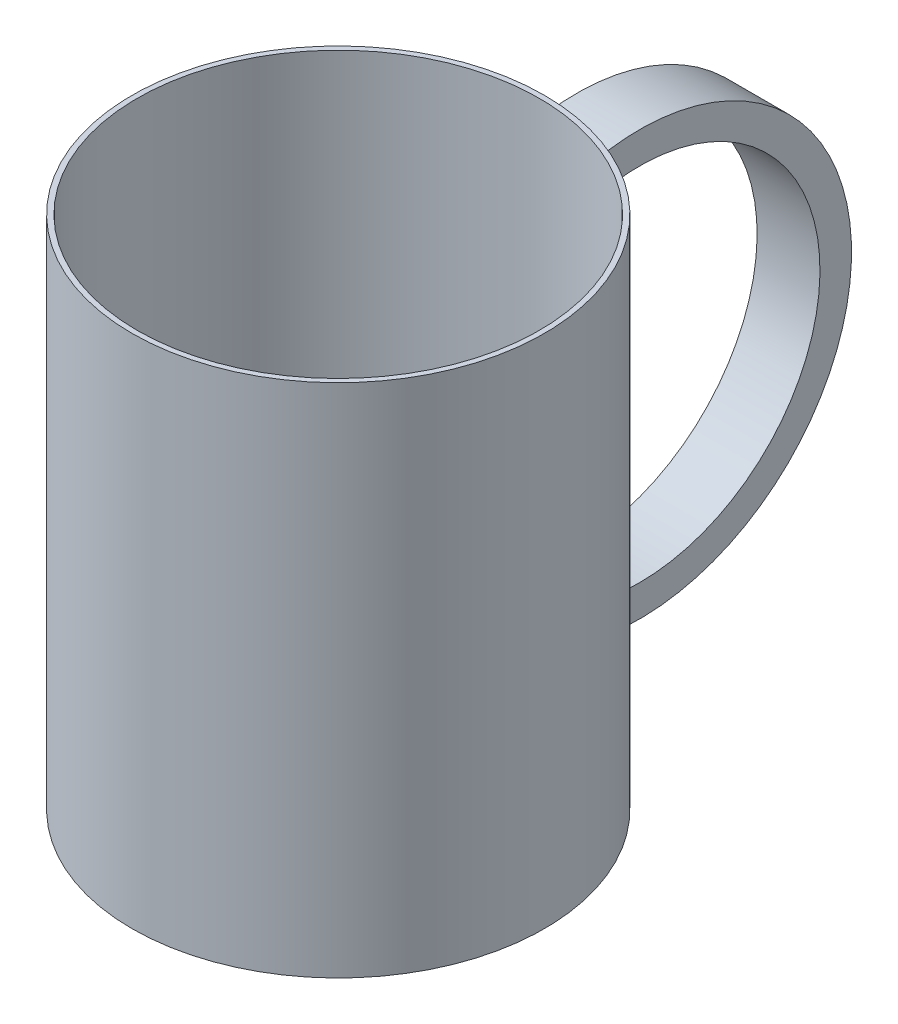
ISO-10303-21;
HEADER;
FILE_DESCRIPTION(('STEP AP214'),'2;1');
FILE_NAME('part.step','',(''),(''),'','','');
FILE_SCHEMA(('AUTOMOTIVE_DESIGN { 1 0 10303 214 1 1 1 1 }'));
ENDSEC;
DATA;
#1=APPLICATION_CONTEXT('core data for automotive mechanical design processes');
#2=APPLICATION_PROTOCOL_DEFINITION('international standard','automotive_design',2000,#1);
#3=PRODUCT_CONTEXT('',#1,'mechanical');
#4=PRODUCT('Part','Part','',(#3));
#5=PRODUCT_RELATED_PRODUCT_CATEGORY('part','',(#4));
#6=PRODUCT_DEFINITION_FORMATION('','',#4);
#7=PRODUCT_DEFINITION_CONTEXT('part definition',#1,'design');
#8=PRODUCT_DEFINITION('design','',#6,#7);
#9=PRODUCT_DEFINITION_SHAPE('','',#8);
#10=(LENGTH_UNIT() NAMED_UNIT(*) SI_UNIT(.MILLI.,.METRE.));
#11=(NAMED_UNIT(*) PLANE_ANGLE_UNIT() SI_UNIT($,.RADIAN.));
#12=(NAMED_UNIT(*) SI_UNIT($,.STERADIAN.) SOLID_ANGLE_UNIT());
#13=UNCERTAINTY_MEASURE_WITH_UNIT(LENGTH_MEASURE(1.E-05),#10,'distance_accuracy_value','');
#14=(GEOMETRIC_REPRESENTATION_CONTEXT(3) GLOBAL_UNCERTAINTY_ASSIGNED_CONTEXT((#13)) GLOBAL_UNIT_ASSIGNED_CONTEXT((#10,
#11,#12)) REPRESENTATION_CONTEXT('',''));
#15=CARTESIAN_POINT('',(0.,0.,0.));
#16=DIRECTION('',(0.,0.,1.));
#17=DIRECTION('',(1.,0.,0.));
#18=AXIS2_PLACEMENT_3D('',#15,#16,#17);
#19=CARTESIAN_POINT('',(0.,-50.,0.));
#20=DIRECTION('',(0.,-1.,0.));
#21=DIRECTION('',(0.,0.,-1.));
#22=AXIS2_PLACEMENT_3D('',#19,#20,#21);
#23=CYLINDRICAL_SURFACE('',#22,40.);
#24=CARTESIAN_POINT('',(0.,50.,0.));
#25=DIRECTION('',(0.,-1.,0.));
#26=DIRECTION('',(0.,0.,-1.));
#27=AXIS2_PLACEMENT_3D('',#24,#25,#26);
#28=CIRCLE('',#27,40.);
#29=CARTESIAN_POINT('',(0.,50.,-40.));
#30=VERTEX_POINT('',#29);
#31=EDGE_CURVE('E133',#30,#30,#28,.T.);
#32=ORIENTED_EDGE('',*,*,#31,.T.);
#33=EDGE_LOOP('',(#32));
#34=FACE_BOUND('',#33,.T.);
#35=CARTESIAN_POINT('',(0.,-50.,0.));
#36=DIRECTION('',(0.,-1.,0.));
#37=DIRECTION('',(0.,0.,-1.));
#38=AXIS2_PLACEMENT_3D('',#35,#36,#37);
#39=CIRCLE('',#38,40.);
#40=CARTESIAN_POINT('',(0.,-50.,-40.));
#41=VERTEX_POINT('',#40);
#42=EDGE_CURVE('E130',#41,#41,#39,.T.);
#43=ORIENTED_EDGE('',*,*,#42,.F.);
#44=EDGE_LOOP('',(#43));
#45=FACE_BOUND('',#44,.T.);
#46=DIRECTION('',(0.,-1.,0.));
#47=VECTOR('',#46,1.);
#48=CARTESIAN_POINT('',(-6.09820692471885,-50.,-39.5324154625456));
#49=LINE('',#48,#47);
#50=CARTESIAN_POINT('',(-6.09820692471885,37.3635523032861,-39.5324154625455));
#51=VERTEX_POINT('',#50);
#52=CARTESIAN_POINT('',(-6.09820692471885,32.5695877140828,-39.5324154625455));
#53=VERTEX_POINT('',#52);
#54=EDGE_CURVE('E166',#51,#53,#49,.T.);
#55=ORIENTED_EDGE('',*,*,#54,.T.);
#56=CARTESIAN_POINT('',(-6.09820692471885,32.5695877140828,-39.5324154625455));
#57=CARTESIAN_POINT('',(-5.59291528432792,32.6002324592508,-39.6103698923773));
#58=CARTESIAN_POINT('',(-5.08588862471012,32.6267935183053,-39.6786560820998));
#59=CARTESIAN_POINT('',(-4.06925047948424,32.6720271218711,-39.7957638779706));
#60=CARTESIAN_POINT('',(-3.55963903892991,32.6906998034049,-39.8445858222154));
#61=CARTESIAN_POINT('',(-2.54210427331402,32.720337367958,-39.9223793921129));
#62=CARTESIAN_POINT('',(-2.03419236567426,32.7313528387092,-39.951481266514));
#63=CARTESIAN_POINT('',(-1.01752030733764,32.7460225992917,-39.9902916045031));
#64=CARTESIAN_POINT('',(-0.508760153668818,32.7496768632776,-40.));
#65=CARTESIAN_POINT('',(0.508760153668819,32.7496768632776,-40.));
#66=CARTESIAN_POINT('',(1.01752030733764,32.7460225992917,-39.9902916045031));
#67=CARTESIAN_POINT('',(2.03419236567427,32.7313528387092,-39.951481266514));
#68=CARTESIAN_POINT('',(2.54210427331402,32.720337367958,-39.9223793921129));
#69=CARTESIAN_POINT('',(3.55963903892991,32.6906998034049,-39.8445858222154));
#70=CARTESIAN_POINT('',(4.06925047948424,32.6720271218711,-39.7957638779706));
#71=CARTESIAN_POINT('',(5.08588862471012,32.6267935183053,-39.6786560820998));
#72=CARTESIAN_POINT('',(5.59291528432793,32.6002324592508,-39.6103698923773));
#73=CARTESIAN_POINT('',(6.09820692471885,32.5695877140828,-39.5324154625455));
#74=B_SPLINE_CURVE_WITH_KNOTS('',3,(#56,#57,#58,#59,#60,#61,#62,#63,#64,#65,#66,#67,#68,#69,#70,
#71,#72,#73),.UNSPECIFIED.,.F.,.F.,(4,2,2,2,2,2,2,2,4),(0.,1.53644528988246,3.07286389033539,
4.59903304557989,6.12520755924747,7.65138207291506,9.17755122815956,10.7139698286125,
12.2504151184949),.UNSPECIFIED.);
#75=CARTESIAN_POINT('',(6.09820692471885,32.5695877140828,-39.5324154625455));
#76=VERTEX_POINT('',#75);
#77=EDGE_CURVE('E161',#53,#76,#74,.T.);
#78=ORIENTED_EDGE('',*,*,#77,.T.);
#79=DIRECTION('',(0.,-1.,0.));
#80=VECTOR('',#79,1.);
#81=CARTESIAN_POINT('',(6.09820692471885,-50.,-39.5324154625456));
#82=LINE('',#81,#80);
#83=CARTESIAN_POINT('',(6.09820692471885,37.3635523032861,-39.5324154625455));
#84=VERTEX_POINT('',#83);
#85=EDGE_CURVE('E48',#76,#84,#82,.F.);
#86=ORIENTED_EDGE('',*,*,#85,.T.);
#87=CARTESIAN_POINT('',(6.09820692471885,39.0692531918104,-39.5324154625455));
#88=VERTEX_POINT('',#87);
#89=EDGE_CURVE('E49',#84,#88,#82,.F.);
#90=ORIENTED_EDGE('',*,*,#89,.T.);
#91=CARTESIAN_POINT('',(6.09820692471885,39.0692531918104,-39.5324154625455));
#92=CARTESIAN_POINT('',(5.59279621960646,39.0948062821816,-39.6103871284577));
#93=CARTESIAN_POINT('',(5.08572284981752,39.1169598298481,-39.6786769432914));
#94=CARTESIAN_POINT('',(4.06909479482348,39.1546943552891,-39.7957800469748));
#95=CARTESIAN_POINT('',(3.55954014122849,39.1702754165728,-39.8445935832874));
#96=CARTESIAN_POINT('',(2.54205339852268,39.1950125554507,-39.9223830828535));
#97=CARTESIAN_POINT('',(2.03413185712739,39.2042091918517,-39.9514842451469));
#98=CARTESIAN_POINT('',(1.01747354477686,39.216457097937,-39.9902927207864));
#99=CARTESIAN_POINT('',(0.508736772388432,39.2195083568057,-40.));
#100=CARTESIAN_POINT('',(-0.508736772388432,39.2195083568057,-40.));
#101=CARTESIAN_POINT('',(-1.01747354477686,39.216457097937,-39.9902927207864));
#102=CARTESIAN_POINT('',(-2.03413185712739,39.2042091918517,-39.9514842451469));
#103=CARTESIAN_POINT('',(-2.54205339852268,39.1950125554507,-39.9223830828535));
#104=CARTESIAN_POINT('',(-3.55954014122849,39.1702754165728,-39.8445935832874));
#105=CARTESIAN_POINT('',(-4.06909479482348,39.1546943552891,-39.7957800469748));
#106=CARTESIAN_POINT('',(-5.08572284981752,39.1169598298482,-39.6786769432914));
#107=CARTESIAN_POINT('',(-5.59279621960646,39.0948062821817,-39.6103871284577));
#108=CARTESIAN_POINT('',(-6.09820692471885,39.0692531918104,-39.5324154625455));
#109=B_SPLINE_CURVE_WITH_KNOTS('',3,(#91,#92,#93,#94,#95,#96,#97,#98,#99,#100,#101,#102,#103,
#104,#105,#106,#107,#108),.UNSPECIFIED.,.F.,.F.,(4,2,2,2,2,2,2,2,4),(0.,1.53597438837162,
3.0719292602517,4.59803499557548,6.12414341679238,7.65025183800928,9.17635757333307,
10.7123124452131,12.2482868335848),.UNSPECIFIED.);
#110=CARTESIAN_POINT('',(-6.09820692471885,39.0692531918104,-39.5324154625455));
#111=VERTEX_POINT('',#110);
#112=EDGE_CURVE('E136',#88,#111,#109,.T.);
#113=ORIENTED_EDGE('',*,*,#112,.T.);
#114=EDGE_CURVE('E144',#111,#51,#49,.T.);
#115=ORIENTED_EDGE('',*,*,#114,.T.);
#116=EDGE_LOOP('',(#55,#78,#86,#90,#113,#115));
#117=FACE_BOUND('',#116,.T.);
#118=CARTESIAN_POINT('',(-6.09820692471885,-39.0692531918104,-39.5324154625456));
#119=CARTESIAN_POINT('',(-5.59279621960646,-39.0948062821817,-39.6103871284578));
#120=CARTESIAN_POINT('',(-5.08572284981752,-39.1169598298482,-39.6786769432914));
#121=CARTESIAN_POINT('',(-4.06909479482348,-39.1546943552892,-39.7957800469748));
#122=CARTESIAN_POINT('',(-3.55954014122849,-39.1702754165728,-39.8445935832874));
#123=CARTESIAN_POINT('',(-2.54205339852268,-39.1950125554507,-39.9223830828535));
#124=CARTESIAN_POINT('',(-2.03413185712739,-39.2042091918517,-39.9514842451469));
#125=CARTESIAN_POINT('',(-1.01747354477686,-39.216457097937,-39.9902927207865));
#126=CARTESIAN_POINT('',(-0.508736772388432,-39.2195083568057,-40.));
#127=CARTESIAN_POINT('',(0.508736772388431,-39.2195083568057,-40.));
#128=CARTESIAN_POINT('',(1.01747354477686,-39.216457097937,-39.9902927207865));
#129=CARTESIAN_POINT('',(2.03413185712739,-39.2042091918517,-39.9514842451469));
#130=CARTESIAN_POINT('',(2.54205339852268,-39.1950125554507,-39.9223830828535));
#131=CARTESIAN_POINT('',(3.55954014122849,-39.1702754165728,-39.8445935832874));
#132=CARTESIAN_POINT('',(4.06909479482348,-39.1546943552892,-39.7957800469748));
#133=CARTESIAN_POINT('',(5.08572284981752,-39.1169598298482,-39.6786769432914));
#134=CARTESIAN_POINT('',(5.59279621960646,-39.0948062821817,-39.6103871284578));
#135=CARTESIAN_POINT('',(6.09820692471885,-39.0692531918104,-39.5324154625456));
#136=B_SPLINE_CURVE_WITH_KNOTS('',3,(#118,#119,#120,#121,#122,#123,#124,#125,#126,#127,#128,
#129,#130,#131,#132,#133,#134,#135),.UNSPECIFIED.,.F.,.F.,(4,2,2,2,2,2,2,2,4),(0.,
1.53597438837162,3.0719292602517,4.59803499557548,6.12414341679238,7.65025183800928,
9.17635757333306,10.7123124452131,12.2482868335848),.UNSPECIFIED.);
#137=CARTESIAN_POINT('',(-6.09820692471885,-39.0692531918104,-39.5324154625456));
#138=VERTEX_POINT('',#137);
#139=CARTESIAN_POINT('',(6.09820692471885,-39.0692531918104,-39.5324154625456));
#140=VERTEX_POINT('',#139);
#141=EDGE_CURVE('E153',#138,#140,#136,.T.);
#142=ORIENTED_EDGE('',*,*,#141,.T.);
#143=CARTESIAN_POINT('',(6.09820692471885,-32.5695877140829,-39.5324154625456));
#144=VERTEX_POINT('',#143);
#145=EDGE_CURVE('E11',#140,#144,#82,.F.);
#146=ORIENTED_EDGE('',*,*,#145,.T.);
#147=CARTESIAN_POINT('',(6.09820692471885,-32.5695877140828,-39.5324154625456));
#148=CARTESIAN_POINT('',(5.59291528432792,-32.6002324592508,-39.6103698923773));
#149=CARTESIAN_POINT('',(5.08588862471012,-32.6267935183053,-39.6786560820999));
#150=CARTESIAN_POINT('',(4.06925047948424,-32.6720271218711,-39.7957638779706));
#151=CARTESIAN_POINT('',(3.55963903892991,-32.6906998034049,-39.8445858222154));
#152=CARTESIAN_POINT('',(2.54210427331402,-32.720337367958,-39.9223793921129));
#153=CARTESIAN_POINT('',(2.03419236567426,-32.7313528387092,-39.951481266514));
#154=CARTESIAN_POINT('',(1.01752030733764,-32.7460225992917,-39.9902916045032));
#155=CARTESIAN_POINT('',(0.508760153668818,-32.7496768632776,-40.));
#156=CARTESIAN_POINT('',(-0.508760153668819,-32.7496768632776,-40.));
#157=CARTESIAN_POINT('',(-1.01752030733764,-32.7460225992917,-39.9902916045032));
#158=CARTESIAN_POINT('',(-2.03419236567427,-32.7313528387092,-39.951481266514));
#159=CARTESIAN_POINT('',(-2.54210427331402,-32.720337367958,-39.9223793921129));
#160=CARTESIAN_POINT('',(-3.55963903892991,-32.6906998034049,-39.8445858222154));
#161=CARTESIAN_POINT('',(-4.06925047948424,-32.6720271218711,-39.7957638779706));
#162=CARTESIAN_POINT('',(-5.08588862471012,-32.6267935183053,-39.6786560820999));
#163=CARTESIAN_POINT('',(-5.59291528432793,-32.6002324592508,-39.6103698923773));
#164=CARTESIAN_POINT('',(-6.09820692471885,-32.5695877140828,-39.5324154625456));
#165=B_SPLINE_CURVE_WITH_KNOTS('',3,(#147,#148,#149,#150,#151,#152,#153,#154,#155,#156,#157,
#158,#159,#160,#161,#162,#163,#164),.UNSPECIFIED.,.F.,.F.,(4,2,2,2,2,2,2,2,4),(0.,
1.53644528988246,3.07286389033539,4.59903304557989,6.12520755924748,7.65138207291506,
9.17755122815956,10.7139698286125,12.2504151184949),.UNSPECIFIED.);
#166=CARTESIAN_POINT('',(-6.09820692471885,-32.5695877140828,-39.5324154625456));
#167=VERTEX_POINT('',#166);
#168=EDGE_CURVE('E36',#144,#167,#165,.T.);
#169=ORIENTED_EDGE('',*,*,#168,.T.);
#170=EDGE_CURVE('E160',#167,#138,#49,.T.);
#171=ORIENTED_EDGE('',*,*,#170,.T.);
#172=EDGE_LOOP('',(#142,#146,#169,#171));
#173=FACE_BOUND('',#172,.T.);
#174=ADVANCED_FACE('F32',(#34,#45,#117,#173),#23,.T.);
#175=CARTESIAN_POINT('',(0.,-50.,-40.));
#176=DIRECTION('',(0.,-1.,0.));
#177=DIRECTION('',(0.,0.,-1.));
#178=AXIS2_PLACEMENT_3D('',#175,#176,#177);
#179=PLANE('',#178);
#180=ORIENTED_EDGE('',*,*,#42,.T.);
#181=EDGE_LOOP('',(#180));
#182=FACE_BOUND('',#181,.T.);
#183=ADVANCED_FACE('F34',(#182),#179,.T.);
#184=CARTESIAN_POINT('',(0.,50.,0.));
#185=DIRECTION('',(0.,1.,0.));
#186=DIRECTION('',(0.,0.,1.));
#187=AXIS2_PLACEMENT_3D('',#184,#185,#186);
#188=PLANE('',#187);
#189=CARTESIAN_POINT('',(0.,50.,0.));
#190=DIRECTION('',(0.,1.,0.));
#191=DIRECTION('',(0.,0.,1.));
#192=AXIS2_PLACEMENT_3D('',#189,#190,#191);
#193=CIRCLE('',#192,39.);
#194=CARTESIAN_POINT('',(0.,50.,39.));
#195=VERTEX_POINT('',#194);
#196=EDGE_CURVE('E102',#195,#195,#193,.T.);
#197=ORIENTED_EDGE('',*,*,#196,.F.);
#198=EDGE_LOOP('',(#197));
#199=FACE_BOUND('',#198,.T.);
#200=ORIENTED_EDGE('',*,*,#31,.F.);
#201=EDGE_LOOP('',(#200));
#202=FACE_BOUND('',#201,.T.);
#203=ADVANCED_FACE('F188',(#199,#202),#188,.T.);
#204=CARTESIAN_POINT('',(6.09820692471885,38.8933028487715,-39.0078388111712));
#205=DIRECTION('',(-1.,0.,0.));
#206=DIRECTION('',(0.,0.,1.));
#207=AXIS2_PLACEMENT_3D('',#204,#205,#206);
#208=PLANE('',#207);
#209=ORIENTED_EDGE('',*,*,#145,.F.);
#210=CARTESIAN_POINT('',(6.09820692471885,0.,-52.3449927867047));
#211=DIRECTION('',(1.,0.,0.));
#212=DIRECTION('',(0.,0.945928728679349,0.32437453700787));
#213=AXIS2_PLACEMENT_3D('',#210,#211,#212);
#214=CIRCLE('',#213,41.1165256636956);
#215=EDGE_CURVE('E56',#140,#88,#214,.T.);
#216=ORIENTED_EDGE('',*,*,#215,.T.);
#217=ORIENTED_EDGE('',*,*,#89,.F.);
#218=DIRECTION('',(0.,-0.945928728679349,-0.32437453700787));
#219=VECTOR('',#218,1.);
#220=CARTESIAN_POINT('',(6.09820692471885,38.8933028487715,-39.0078388111712));
#221=LINE('',#220,#219);
#222=CARTESIAN_POINT('',(6.09820692471885,33.1066971512285,-40.9921611888288));
#223=VERTEX_POINT('',#222);
#224=EDGE_CURVE('E93',#84,#223,#221,.T.);
#225=ORIENTED_EDGE('',*,*,#224,.T.);
#226=CARTESIAN_POINT('',(6.09820692471885,0.,-52.3449927867047));
#227=DIRECTION('',(1.,0.,0.));
#228=DIRECTION('',(0.,0.945928728679349,0.32437453700787));
#229=AXIS2_PLACEMENT_3D('',#226,#227,#228);
#230=CIRCLE('',#229,34.9991454403232);
#231=EDGE_CURVE('E96',#144,#223,#230,.T.);
#232=ORIENTED_EDGE('',*,*,#231,.F.);
#233=EDGE_LOOP('',(#209,#216,#217,#225,#232));
#234=FACE_BOUND('',#233,.T.);
#235=ADVANCED_FACE('F95',(#234),#208,.F.);
#236=CARTESIAN_POINT('',(0.,0.,-52.3449927867047));
#237=DIRECTION('',(1.,0.,0.));
#238=DIRECTION('',(0.,0.,-1.));
#239=AXIS2_PLACEMENT_3D('',#236,#237,#238);
#240=CYLINDRICAL_SURFACE('',#239,34.9991454403232);
#241=ORIENTED_EDGE('',*,*,#77,.F.);
#242=CARTESIAN_POINT('',(-6.09820692471885,0.,-52.3449927867047));
#243=DIRECTION('',(1.,0.,0.));
#244=DIRECTION('',(0.,0.945928728679349,0.32437453700787));
#245=AXIS2_PLACEMENT_3D('',#242,#243,#244);
#246=CIRCLE('',#245,34.9991454403232);
#247=CARTESIAN_POINT('',(-6.09820692471885,33.1066971512285,-40.9921611888288));
#248=VERTEX_POINT('',#247);
#249=EDGE_CURVE('E120',#248,#53,#246,.T.);
#250=ORIENTED_EDGE('',*,*,#249,.F.);
#251=DIRECTION('',(-1.,0.,0.));
#252=VECTOR('',#251,1.);
#253=CARTESIAN_POINT('',(6.09820692471885,33.1066971512285,-40.9921611888288));
#254=LINE('',#253,#252);
#255=EDGE_CURVE('E101',#223,#248,#254,.T.);
#256=ORIENTED_EDGE('',*,*,#255,.F.);
#257=EDGE_CURVE('E111',#223,#76,#230,.T.);
#258=ORIENTED_EDGE('',*,*,#257,.T.);
#259=EDGE_LOOP('',(#241,#250,#256,#258));
#260=FACE_BOUND('',#259,.T.);
#261=ADVANCED_FACE('F118',(#260),#240,.F.);
#262=CARTESIAN_POINT('',(-6.09820692471885,38.8933028487715,-39.0078388111712));
#263=DIRECTION('',(1.,0.,0.));
#264=DIRECTION('',(0.,0.,-1.));
#265=AXIS2_PLACEMENT_3D('',#262,#263,#264);
#266=PLANE('',#265);
#267=ORIENTED_EDGE('',*,*,#54,.F.);
#268=DIRECTION('',(0.,0.945928728679349,0.32437453700787));
#269=VECTOR('',#268,1.);
#270=CARTESIAN_POINT('',(-6.09820692471885,38.8933028487715,-39.0078388111712));
#271=LINE('',#270,#269);
#272=EDGE_CURVE('E122',#248,#51,#271,.T.);
#273=ORIENTED_EDGE('',*,*,#272,.F.);
#274=ORIENTED_EDGE('',*,*,#249,.T.);
#275=EDGE_LOOP('',(#267,#273,#274));
#276=FACE_BOUND('',#275,.T.);
#277=ADVANCED_FACE('F173',(#276),#266,.F.);
#278=ORIENTED_EDGE('',*,*,#85,.F.);
#279=ORIENTED_EDGE('',*,*,#257,.F.);
#280=ORIENTED_EDGE('',*,*,#224,.F.);
#281=EDGE_LOOP('',(#278,#279,#280));
#282=FACE_BOUND('',#281,.T.);
#283=ADVANCED_FACE('F114',(#282),#208,.F.);
#284=ORIENTED_EDGE('',*,*,#168,.F.);
#285=ORIENTED_EDGE('',*,*,#231,.T.);
#286=ORIENTED_EDGE('',*,*,#255,.T.);
#287=EDGE_CURVE('E117',#167,#248,#246,.T.);
#288=ORIENTED_EDGE('',*,*,#287,.F.);
#289=EDGE_LOOP('',(#284,#285,#286,#288));
#290=FACE_BOUND('',#289,.T.);
#291=ADVANCED_FACE('F106',(#290),#240,.F.);
#292=ORIENTED_EDGE('',*,*,#114,.F.);
#293=CARTESIAN_POINT('',(-6.09820692471885,0.,-52.3449927867047));
#294=DIRECTION('',(1.,0.,0.));
#295=DIRECTION('',(0.,0.945928728679349,0.32437453700787));
#296=AXIS2_PLACEMENT_3D('',#293,#294,#295);
#297=CIRCLE('',#296,41.1165256636956);
#298=EDGE_CURVE('E61',#138,#111,#297,.T.);
#299=ORIENTED_EDGE('',*,*,#298,.F.);
#300=ORIENTED_EDGE('',*,*,#170,.F.);
#301=ORIENTED_EDGE('',*,*,#287,.T.);
#302=ORIENTED_EDGE('',*,*,#272,.T.);
#303=EDGE_LOOP('',(#292,#299,#300,#301,#302));
#304=FACE_BOUND('',#303,.T.);
#305=ADVANCED_FACE('F151',(#304),#266,.F.);
#306=CARTESIAN_POINT('',(0.,0.,-52.3449927867047));
#307=DIRECTION('',(1.,0.,0.));
#308=DIRECTION('',(0.,0.,-1.));
#309=AXIS2_PLACEMENT_3D('',#306,#307,#308);
#310=CYLINDRICAL_SURFACE('',#309,41.1165256636956);
#311=ORIENTED_EDGE('',*,*,#141,.F.);
#312=ORIENTED_EDGE('',*,*,#298,.T.);
#313=ORIENTED_EDGE('',*,*,#112,.F.);
#314=ORIENTED_EDGE('',*,*,#215,.F.);
#315=EDGE_LOOP('',(#311,#312,#313,#314));
#316=FACE_BOUND('',#315,.T.);
#317=ADVANCED_FACE('F146',(#316),#310,.T.);
#318=CARTESIAN_POINT('',(0.,50.,0.));
#319=DIRECTION('',(0.,-1.,0.));
#320=DIRECTION('',(0.,0.,-1.));
#321=AXIS2_PLACEMENT_3D('',#318,#319,#320);
#322=CYLINDRICAL_SURFACE('',#321,39.);
#323=ORIENTED_EDGE('',*,*,#196,.T.);
#324=EDGE_LOOP('',(#323));
#325=FACE_BOUND('',#324,.T.);
#326=CARTESIAN_POINT('',(0.,-40.,0.));
#327=DIRECTION('',(0.,1.,0.));
#328=DIRECTION('',(0.,0.,1.));
#329=AXIS2_PLACEMENT_3D('',#326,#327,#328);
#330=CIRCLE('',#329,39.);
#331=CARTESIAN_POINT('',(0.,-40.,39.));
#332=VERTEX_POINT('',#331);
#333=EDGE_CURVE('E277',#332,#332,#330,.T.);
#334=ORIENTED_EDGE('',*,*,#333,.F.);
#335=EDGE_LOOP('',(#334));
#336=FACE_BOUND('',#335,.T.);
#337=ADVANCED_FACE('F150',(#325,#336),#322,.F.);
#338=CARTESIAN_POINT('',(0.,-40.,0.));
#339=DIRECTION('',(0.,1.,0.));
#340=DIRECTION('',(0.,0.,1.));
#341=AXIS2_PLACEMENT_3D('',#338,#339,#340);
#342=PLANE('',#341);
#343=ORIENTED_EDGE('',*,*,#333,.T.);
#344=EDGE_LOOP('',(#343));
#345=FACE_BOUND('',#344,.T.);
#346=ADVANCED_FACE('F176',(#345),#342,.T.);
#347=CLOSED_SHELL('',(#174,#183,#203,#235,#261,#277,#283,#291,#305,#317,#337,#346));
#348=MANIFOLD_SOLID_BREP('B2',#347);
#349=ADVANCED_BREP_SHAPE_REPRESENTATION('',(#18,#348),#14);
#350=SHAPE_DEFINITION_REPRESENTATION(#9,#349);
ENDSEC;
END-ISO-10303-21;
